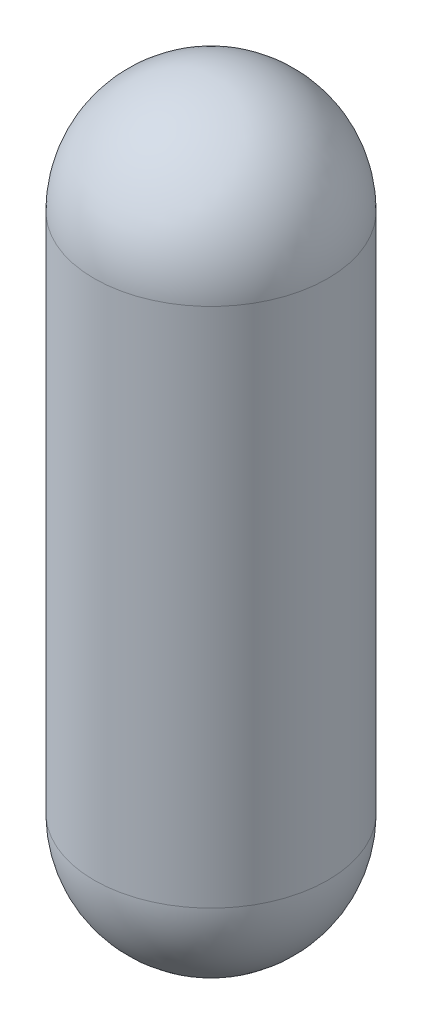
ISO-10303-21;
HEADER;
FILE_DESCRIPTION(('STEP AP214'),'2;1');
FILE_NAME('part.step','',(''),(''),'','','');
FILE_SCHEMA(('AUTOMOTIVE_DESIGN { 1 0 10303 214 1 1 1 1 }'));
ENDSEC;
DATA;
#1=APPLICATION_CONTEXT('core data for automotive mechanical design processes');
#2=APPLICATION_PROTOCOL_DEFINITION('international standard','automotive_design',2000,#1);
#3=PRODUCT_CONTEXT('',#1,'mechanical');
#4=PRODUCT('Part','Part','',(#3));
#5=PRODUCT_RELATED_PRODUCT_CATEGORY('part','',(#4));
#6=PRODUCT_DEFINITION_FORMATION('','',#4);
#7=PRODUCT_DEFINITION_CONTEXT('part definition',#1,'design');
#8=PRODUCT_DEFINITION('design','',#6,#7);
#9=PRODUCT_DEFINITION_SHAPE('','',#8);
#10=(LENGTH_UNIT() NAMED_UNIT(*) SI_UNIT(.MILLI.,.METRE.));
#11=(NAMED_UNIT(*) PLANE_ANGLE_UNIT() SI_UNIT($,.RADIAN.));
#12=(NAMED_UNIT(*) SI_UNIT($,.STERADIAN.) SOLID_ANGLE_UNIT());
#13=UNCERTAINTY_MEASURE_WITH_UNIT(LENGTH_MEASURE(1.E-05),#10,'distance_accuracy_value','');
#14=(GEOMETRIC_REPRESENTATION_CONTEXT(3) GLOBAL_UNCERTAINTY_ASSIGNED_CONTEXT((#13)) GLOBAL_UNIT_ASSIGNED_CONTEXT((#10,
#11,#12)) REPRESENTATION_CONTEXT('',''));
#15=CARTESIAN_POINT('',(0.,0.,0.));
#16=DIRECTION('',(0.,0.,1.));
#17=DIRECTION('',(1.,0.,0.));
#18=AXIS2_PLACEMENT_3D('',#15,#16,#17);
#19=CARTESIAN_POINT('',(0.,-82.55,0.));
#20=DIRECTION('',(0.,-1.,0.));
#21=DIRECTION('',(1.,0.,0.));
#22=AXIS2_PLACEMENT_3D('',#19,#20,#21);
#23=SPHERICAL_SURFACE('',#22,82.55);
#24=CARTESIAN_POINT('',(0.,-82.55,0.));
#25=DIRECTION('',(0.,-1.,0.));
#26=DIRECTION('',(0.,0.,-1.));
#27=AXIS2_PLACEMENT_3D('',#24,#25,#26);
#28=CIRCLE('',#27,82.55);
#29=CARTESIAN_POINT('',(0.,-82.55,-82.55));
#30=VERTEX_POINT('',#29);
#31=EDGE_CURVE('E10',#30,#30,#28,.T.);
#32=ORIENTED_EDGE('',*,*,#31,.F.);
#33=EDGE_LOOP('',(#32));
#34=FACE_BOUND('',#33,.T.);
#35=ADVANCED_FACE('F37',(#34),#23,.T.);
#36=CARTESIAN_POINT('',(0.,-533.4,0.));
#37=DIRECTION('',(0.,-1.,0.));
#38=DIRECTION('',(0.,0.,-1.));
#39=AXIS2_PLACEMENT_3D('',#36,#37,#38);
#40=CYLINDRICAL_SURFACE('',#39,82.55);
#41=CARTESIAN_POINT('',(0.,-450.85,0.));
#42=DIRECTION('',(0.,-1.,0.));
#43=DIRECTION('',(0.,0.,-1.));
#44=AXIS2_PLACEMENT_3D('',#41,#42,#43);
#45=CIRCLE('',#44,82.5499999999999);
#46=CARTESIAN_POINT('',(0.,-450.85,-82.5499999999999));
#47=VERTEX_POINT('',#46);
#48=EDGE_CURVE('E44',#47,#47,#45,.T.);
#49=ORIENTED_EDGE('',*,*,#48,.F.);
#50=EDGE_LOOP('',(#49));
#51=FACE_BOUND('',#50,.T.);
#52=ORIENTED_EDGE('',*,*,#31,.T.);
#53=EDGE_LOOP('',(#52));
#54=FACE_BOUND('',#53,.T.);
#55=ADVANCED_FACE('F53',(#51,#54),#40,.T.);
#56=CARTESIAN_POINT('',(0.,-450.85,0.));
#57=DIRECTION('',(0.,-1.,0.));
#58=DIRECTION('',(-1.,0.,0.));
#59=AXIS2_PLACEMENT_3D('',#56,#57,#58);
#60=SPHERICAL_SURFACE('',#59,82.5499999999999);
#61=ORIENTED_EDGE('',*,*,#48,.T.);
#62=EDGE_LOOP('',(#61));
#63=FACE_BOUND('',#62,.T.);
#64=ADVANCED_FACE('F51',(#63),#60,.T.);
#65=CLOSED_SHELL('',(#35,#55,#64));
#66=MANIFOLD_SOLID_BREP('B2',#65);
#67=ADVANCED_BREP_SHAPE_REPRESENTATION('',(#18,#66),#14);
#68=SHAPE_DEFINITION_REPRESENTATION(#9,#67);
ENDSEC;
END-ISO-10303-21;
